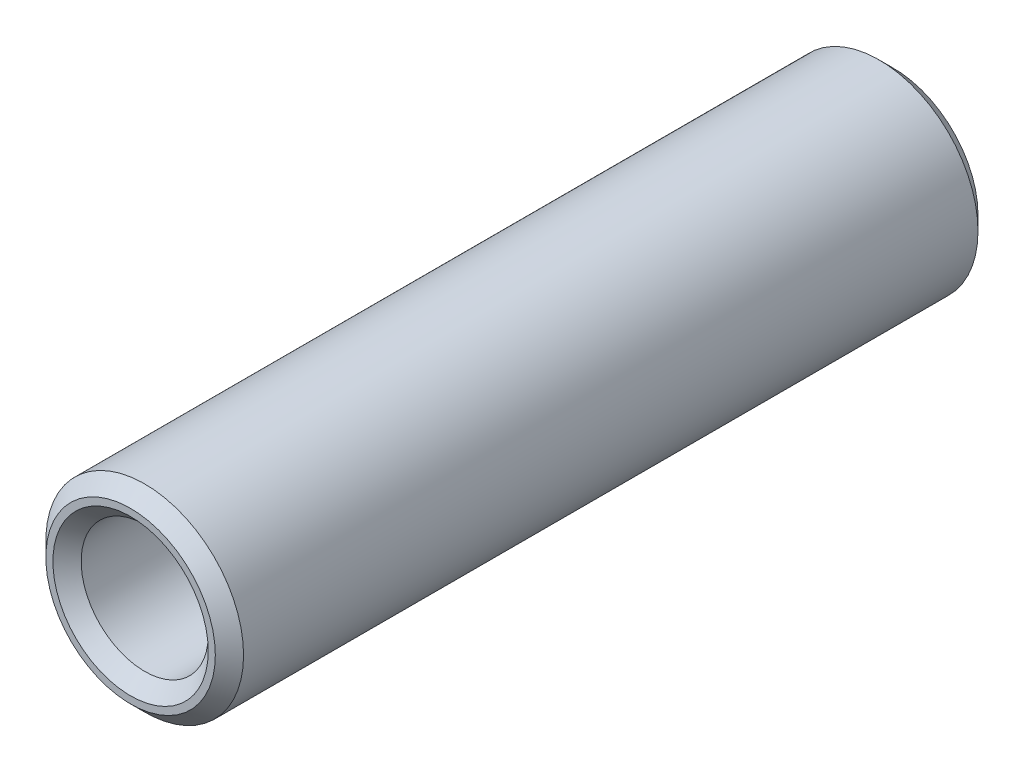
ISO-10303-21;
HEADER;
FILE_DESCRIPTION(('STEP AP214'),'2;1');
FILE_NAME('part.step','',(''),(''),'','','');
FILE_SCHEMA(('AUTOMOTIVE_DESIGN { 1 0 10303 214 1 1 1 1 }'));
ENDSEC;
DATA;
#1=APPLICATION_CONTEXT('core data for automotive mechanical design processes');
#2=APPLICATION_PROTOCOL_DEFINITION('international standard','automotive_design',2000,#1);
#3=PRODUCT_CONTEXT('',#1,'mechanical');
#4=PRODUCT('Part','Part','',(#3));
#5=PRODUCT_RELATED_PRODUCT_CATEGORY('part','',(#4));
#6=PRODUCT_DEFINITION_FORMATION('','',#4);
#7=PRODUCT_DEFINITION_CONTEXT('part definition',#1,'design');
#8=PRODUCT_DEFINITION('design','',#6,#7);
#9=PRODUCT_DEFINITION_SHAPE('','',#8);
#10=(LENGTH_UNIT() NAMED_UNIT(*) SI_UNIT(.MILLI.,.METRE.));
#11=(NAMED_UNIT(*) PLANE_ANGLE_UNIT() SI_UNIT($,.RADIAN.));
#12=(NAMED_UNIT(*) SI_UNIT($,.STERADIAN.) SOLID_ANGLE_UNIT());
#13=UNCERTAINTY_MEASURE_WITH_UNIT(LENGTH_MEASURE(1.E-05),#10,'distance_accuracy_value','');
#14=(GEOMETRIC_REPRESENTATION_CONTEXT(3) GLOBAL_UNCERTAINTY_ASSIGNED_CONTEXT((#13)) GLOBAL_UNIT_ASSIGNED_CONTEXT((#10,
#11,#12)) REPRESENTATION_CONTEXT('',''));
#15=CARTESIAN_POINT('',(0.,0.,0.));
#16=DIRECTION('',(0.,0.,1.));
#17=DIRECTION('',(1.,0.,0.));
#18=AXIS2_PLACEMENT_3D('',#15,#16,#17);
#19=CARTESIAN_POINT('',(0.,0.,27.));
#20=DIRECTION('',(0.,0.,1.));
#21=DIRECTION('',(1.,0.,0.));
#22=AXIS2_PLACEMENT_3D('',#19,#20,#21);
#23=PLANE('',#22);
#24=CARTESIAN_POINT('',(0.,0.,27.));
#25=DIRECTION('',(0.,0.,1.));
#26=DIRECTION('',(1.,0.,0.));
#27=AXIS2_PLACEMENT_3D('',#24,#25,#26);
#28=CIRCLE('',#27,2.75000000000001);
#29=CARTESIAN_POINT('',(2.75000000000001,0.,27.));
#30=VERTEX_POINT('',#29);
#31=EDGE_CURVE('E44',#30,#30,#28,.F.);
#32=ORIENTED_EDGE('',*,*,#31,.T.);
#33=EDGE_LOOP('',(#32));
#34=FACE_BOUND('',#33,.T.);
#35=CARTESIAN_POINT('',(0.,0.,27.));
#36=DIRECTION('',(0.,0.,1.));
#37=DIRECTION('',(1.,0.,0.));
#38=AXIS2_PLACEMENT_3D('',#35,#36,#37);
#39=CIRCLE('',#38,3.);
#40=CARTESIAN_POINT('',(3.,0.,27.));
#41=VERTEX_POINT('',#40);
#42=EDGE_CURVE('E48',#41,#41,#39,.T.);
#43=ORIENTED_EDGE('',*,*,#42,.T.);
#44=EDGE_LOOP('',(#43));
#45=FACE_BOUND('',#44,.T.);
#46=ADVANCED_FACE('F36',(#34,#45),#23,.T.);
#47=CARTESIAN_POINT('',(0.,0.,0.));
#48=DIRECTION('',(0.,0.,1.));
#49=DIRECTION('',(1.,0.,0.));
#50=AXIS2_PLACEMENT_3D('',#47,#48,#49);
#51=PLANE('',#50);
#52=CARTESIAN_POINT('',(0.,0.,0.));
#53=DIRECTION('',(0.,0.,1.));
#54=DIRECTION('',(1.,0.,0.));
#55=AXIS2_PLACEMENT_3D('',#52,#53,#54);
#56=CIRCLE('',#55,2.75000000000001);
#57=CARTESIAN_POINT('',(2.75000000000001,0.,0.));
#58=VERTEX_POINT('',#57);
#59=EDGE_CURVE('E63',#58,#58,#56,.T.);
#60=ORIENTED_EDGE('',*,*,#59,.T.);
#61=EDGE_LOOP('',(#60));
#62=FACE_BOUND('',#61,.T.);
#63=CARTESIAN_POINT('',(0.,0.,0.));
#64=DIRECTION('',(0.,0.,1.));
#65=DIRECTION('',(1.,0.,0.));
#66=AXIS2_PLACEMENT_3D('',#63,#64,#65);
#67=CIRCLE('',#66,2.99999999999999);
#68=CARTESIAN_POINT('',(2.99999999999999,0.,0.));
#69=VERTEX_POINT('',#68);
#70=EDGE_CURVE('E66',#69,#69,#67,.F.);
#71=ORIENTED_EDGE('',*,*,#70,.T.);
#72=EDGE_LOOP('',(#71));
#73=FACE_BOUND('',#72,.T.);
#74=ADVANCED_FACE('F70',(#62,#73),#51,.F.);
#75=CARTESIAN_POINT('',(0.,0.,27.));
#76=DIRECTION('',(0.,0.,-1.));
#77=DIRECTION('',(-1.,0.,0.));
#78=AXIS2_PLACEMENT_3D('',#75,#76,#77);
#79=CYLINDRICAL_SURFACE('',#78,3.5);
#80=CARTESIAN_POINT('',(0.,0.,26.5));
#81=DIRECTION('',(0.,0.,1.));
#82=DIRECTION('',(1.,0.,0.));
#83=AXIS2_PLACEMENT_3D('',#80,#81,#82);
#84=CIRCLE('',#83,3.5);
#85=CARTESIAN_POINT('',(3.5,0.,26.5));
#86=VERTEX_POINT('',#85);
#87=EDGE_CURVE('E10',#86,#86,#84,.F.);
#88=ORIENTED_EDGE('',*,*,#87,.T.);
#89=EDGE_LOOP('',(#88));
#90=FACE_BOUND('',#89,.T.);
#91=CARTESIAN_POINT('',(0.,0.,0.500000000000007));
#92=DIRECTION('',(0.,0.,1.));
#93=DIRECTION('',(1.,0.,0.));
#94=AXIS2_PLACEMENT_3D('',#91,#92,#93);
#95=CIRCLE('',#94,3.5);
#96=CARTESIAN_POINT('',(3.5,0.,0.500000000000007));
#97=VERTEX_POINT('',#96);
#98=EDGE_CURVE('E57',#97,#97,#95,.T.);
#99=ORIENTED_EDGE('',*,*,#98,.T.);
#100=EDGE_LOOP('',(#99));
#101=FACE_BOUND('',#100,.T.);
#102=ADVANCED_FACE('F80',(#90,#101),#79,.T.);
#103=CARTESIAN_POINT('',(0.,0.,27.));
#104=DIRECTION('',(0.,0.,-1.));
#105=DIRECTION('',(-1.,0.,0.));
#106=AXIS2_PLACEMENT_3D('',#103,#104,#105);
#107=CYLINDRICAL_SURFACE('',#106,2.25);
#108=CARTESIAN_POINT('',(0.,0.,26.5));
#109=DIRECTION('',(0.,0.,1.));
#110=DIRECTION('',(1.,0.,0.));
#111=AXIS2_PLACEMENT_3D('',#108,#109,#110);
#112=CIRCLE('',#111,2.25);
#113=CARTESIAN_POINT('',(2.25,0.,26.5));
#114=VERTEX_POINT('',#113);
#115=EDGE_CURVE('E52',#114,#114,#112,.T.);
#116=ORIENTED_EDGE('',*,*,#115,.T.);
#117=EDGE_LOOP('',(#116));
#118=FACE_BOUND('',#117,.T.);
#119=CARTESIAN_POINT('',(0.,0.,0.500000000000004));
#120=DIRECTION('',(0.,0.,1.));
#121=DIRECTION('',(1.,0.,0.));
#122=AXIS2_PLACEMENT_3D('',#119,#120,#121);
#123=CIRCLE('',#122,2.25);
#124=CARTESIAN_POINT('',(2.25,0.,0.500000000000004));
#125=VERTEX_POINT('',#124);
#126=EDGE_CURVE('E60',#125,#125,#123,.F.);
#127=ORIENTED_EDGE('',*,*,#126,.T.);
#128=EDGE_LOOP('',(#127));
#129=FACE_BOUND('',#128,.T.);
#130=ADVANCED_FACE('F82',(#118,#129),#107,.F.);
#131=CARTESIAN_POINT('',(0.,0.,0.));
#132=DIRECTION('',(0.,0.,-1.));
#133=DIRECTION('',(-1.,0.,0.));
#134=AXIS2_PLACEMENT_3D('',#131,#132,#133);
#135=CONICAL_SURFACE('',#134,2.75000000000001,0.78539816339745);
#136=ORIENTED_EDGE('',*,*,#126,.F.);
#137=EDGE_LOOP('',(#136));
#138=FACE_BOUND('',#137,.T.);
#139=ORIENTED_EDGE('',*,*,#59,.F.);
#140=EDGE_LOOP('',(#139));
#141=FACE_BOUND('',#140,.T.);
#142=ADVANCED_FACE('F76',(#138,#141),#135,.F.);
#143=CARTESIAN_POINT('',(0.,0.,0.500000000000007));
#144=DIRECTION('',(0.,0.,1.));
#145=DIRECTION('',(1.,0.,0.));
#146=AXIS2_PLACEMENT_3D('',#143,#144,#145);
#147=CONICAL_SURFACE('',#146,3.5,0.785398163397449);
#148=ORIENTED_EDGE('',*,*,#70,.F.);
#149=EDGE_LOOP('',(#148));
#150=FACE_BOUND('',#149,.T.);
#151=ORIENTED_EDGE('',*,*,#98,.F.);
#152=EDGE_LOOP('',(#151));
#153=FACE_BOUND('',#152,.T.);
#154=ADVANCED_FACE('F72',(#150,#153),#147,.T.);
#155=CARTESIAN_POINT('',(0.,0.,26.5));
#156=DIRECTION('',(0.,0.,1.));
#157=DIRECTION('',(1.,0.,0.));
#158=AXIS2_PLACEMENT_3D('',#155,#156,#157);
#159=CONICAL_SURFACE('',#158,2.25,0.785398163397457);
#160=ORIENTED_EDGE('',*,*,#31,.F.);
#161=EDGE_LOOP('',(#160));
#162=FACE_BOUND('',#161,.T.);
#163=ORIENTED_EDGE('',*,*,#115,.F.);
#164=EDGE_LOOP('',(#163));
#165=FACE_BOUND('',#164,.T.);
#166=ADVANCED_FACE('F75',(#162,#165),#159,.F.);
#167=CARTESIAN_POINT('',(0.,0.,27.));
#168=DIRECTION('',(0.,0.,-1.));
#169=DIRECTION('',(-1.,0.,0.));
#170=AXIS2_PLACEMENT_3D('',#167,#168,#169);
#171=CONICAL_SURFACE('',#170,3.,0.785398163397445);
#172=ORIENTED_EDGE('',*,*,#87,.F.);
#173=EDGE_LOOP('',(#172));
#174=FACE_BOUND('',#173,.T.);
#175=ORIENTED_EDGE('',*,*,#42,.F.);
#176=EDGE_LOOP('',(#175));
#177=FACE_BOUND('',#176,.T.);
#178=ADVANCED_FACE('F39',(#174,#177),#171,.T.);
#179=CLOSED_SHELL('',(#46,#74,#102,#130,#142,#154,#166,#178));
#180=MANIFOLD_SOLID_BREP('B2',#179);
#181=ADVANCED_BREP_SHAPE_REPRESENTATION('',(#18,#180),#14);
#182=SHAPE_DEFINITION_REPRESENTATION(#9,#181);
ENDSEC;
END-ISO-10303-21;
